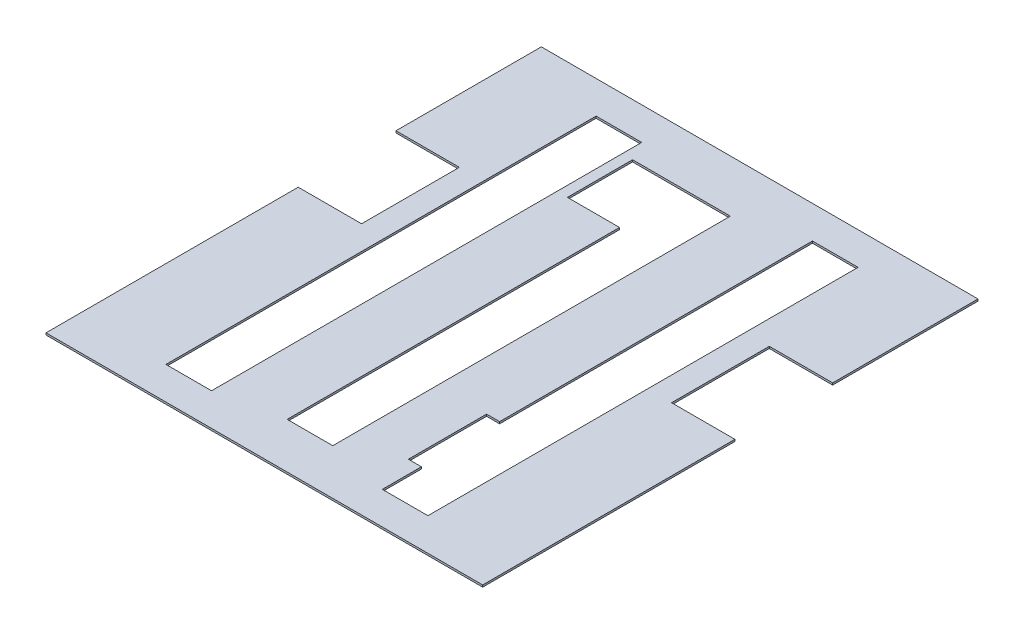
ISO-10303-21;
HEADER;
FILE_DESCRIPTION(('STEP AP214'),'2;1');
FILE_NAME('part.step','',(''),(''),'','','');
FILE_SCHEMA(('AUTOMOTIVE_DESIGN { 1 0 10303 214 1 1 1 1 }'));
ENDSEC;
DATA;
#1=APPLICATION_CONTEXT('core data for automotive mechanical design processes');
#2=APPLICATION_PROTOCOL_DEFINITION('international standard','automotive_design',2000,#1);
#3=PRODUCT_CONTEXT('',#1,'mechanical');
#4=PRODUCT('Part','Part','',(#3));
#5=PRODUCT_RELATED_PRODUCT_CATEGORY('part','',(#4));
#6=PRODUCT_DEFINITION_FORMATION('','',#4);
#7=PRODUCT_DEFINITION_CONTEXT('part definition',#1,'design');
#8=PRODUCT_DEFINITION('design','',#6,#7);
#9=PRODUCT_DEFINITION_SHAPE('','',#8);
#10=(LENGTH_UNIT() NAMED_UNIT(*) SI_UNIT(.MILLI.,.METRE.));
#11=(NAMED_UNIT(*) PLANE_ANGLE_UNIT() SI_UNIT($,.RADIAN.));
#12=(NAMED_UNIT(*) SI_UNIT($,.STERADIAN.) SOLID_ANGLE_UNIT());
#13=UNCERTAINTY_MEASURE_WITH_UNIT(LENGTH_MEASURE(1.E-05),#10,'distance_accuracy_value','');
#14=(GEOMETRIC_REPRESENTATION_CONTEXT(3) GLOBAL_UNCERTAINTY_ASSIGNED_CONTEXT((#13)) GLOBAL_UNIT_ASSIGNED_CONTEXT((#10,
#11,#12)) REPRESENTATION_CONTEXT('',''));
#15=CARTESIAN_POINT('',(0.,0.,0.));
#16=DIRECTION('',(0.,0.,1.));
#17=DIRECTION('',(1.,0.,0.));
#18=AXIS2_PLACEMENT_3D('',#15,#16,#17);
#19=CARTESIAN_POINT('',(6239.08406699949,-8.5,8927.31237778607));
#20=DIRECTION('',(-1.,0.,0.));
#21=DIRECTION('',(0.,0.,1.));
#22=AXIS2_PLACEMENT_3D('',#19,#20,#21);
#23=PLANE('',#22);
#24=DIRECTION('',(0.,0.,1.));
#25=VECTOR('',#24,1.);
#26=CARTESIAN_POINT('',(6239.08406699949,0.,0.));
#27=LINE('',#26,#25);
#28=CARTESIAN_POINT('',(6239.08406699949,0.,8897.31237778607));
#29=VERTEX_POINT('',#28);
#30=CARTESIAN_POINT('',(6239.08406699949,0.,8927.31237778607));
#31=VERTEX_POINT('',#30);
#32=EDGE_CURVE('E450',#29,#31,#27,.T.);
#33=ORIENTED_EDGE('',*,*,#32,.F.);
#34=DIRECTION('',(0.,1.,0.));
#35=VECTOR('',#34,1.);
#36=CARTESIAN_POINT('',(6239.08406699949,-8.5,8897.31237778607));
#37=LINE('',#36,#35);
#38=CARTESIAN_POINT('',(6239.08406699949,1.5,8897.31237778607));
#39=VERTEX_POINT('',#38);
#40=EDGE_CURVE('E41',#29,#39,#37,.T.);
#41=ORIENTED_EDGE('',*,*,#40,.T.);
#42=DIRECTION('',(0.,0.,1.));
#43=VECTOR('',#42,1.);
#44=CARTESIAN_POINT('',(6239.08406699949,1.5,8927.31237778607));
#45=LINE('',#44,#43);
#46=CARTESIAN_POINT('',(6239.08406699949,1.5,8927.31237778607));
#47=VERTEX_POINT('',#46);
#48=EDGE_CURVE('E266',#39,#47,#45,.T.);
#49=ORIENTED_EDGE('',*,*,#48,.T.);
#50=DIRECTION('',(0.,1.,0.));
#51=VECTOR('',#50,1.);
#52=CARTESIAN_POINT('',(6239.08406699949,-8.5,8927.31237778607));
#53=LINE('',#52,#51);
#54=EDGE_CURVE('E276',#31,#47,#53,.T.);
#55=ORIENTED_EDGE('',*,*,#54,.F.);
#56=EDGE_LOOP('',(#33,#41,#49,#55));
#57=FACE_BOUND('',#56,.T.);
#58=ADVANCED_FACE('F33',(#57),#23,.F.);
#59=CARTESIAN_POINT('',(6006.08406699949,1.5,8572.31237778607));
#60=DIRECTION('',(1.,0.,0.));
#61=DIRECTION('',(0.,0.,-1.));
#62=AXIS2_PLACEMENT_3D('',#59,#60,#61);
#63=PLANE('',#62);
#64=DIRECTION('',(0.,0.,1.));
#65=VECTOR('',#64,1.);
#66=CARTESIAN_POINT('',(6006.08406699949,1.5,8572.31237778607));
#67=LINE('',#66,#65);
#68=CARTESIAN_POINT('',(6006.08406699949,1.5,8758.81237778607));
#69=VERTEX_POINT('',#68);
#70=CARTESIAN_POINT('',(6006.08406699949,1.5,8952.31237778607));
#71=VERTEX_POINT('',#70);
#72=EDGE_CURVE('E368',#69,#71,#67,.T.);
#73=ORIENTED_EDGE('',*,*,#72,.F.);
#74=DIRECTION('',(0.,1.,0.));
#75=VECTOR('',#74,1.);
#76=CARTESIAN_POINT('',(6006.08406699949,-8.5,8758.81237778607));
#77=LINE('',#76,#75);
#78=CARTESIAN_POINT('',(6006.08406699949,0.,8758.81237778607));
#79=VERTEX_POINT('',#78);
#80=EDGE_CURVE('E343',#79,#69,#77,.T.);
#81=ORIENTED_EDGE('',*,*,#80,.F.);
#82=DIRECTION('',(0.,0.,1.));
#83=VECTOR('',#82,1.);
#84=CARTESIAN_POINT('',(6006.08406699949,0.,8572.31237778607));
#85=LINE('',#84,#83);
#86=CARTESIAN_POINT('',(6006.08406699949,0.,8952.31237778607));
#87=VERTEX_POINT('',#86);
#88=EDGE_CURVE('E342',#79,#87,#85,.T.);
#89=ORIENTED_EDGE('',*,*,#88,.T.);
#90=DIRECTION('',(0.,-1.,0.));
#91=VECTOR('',#90,1.);
#92=CARTESIAN_POINT('',(6006.08406699949,1.5,8952.31237778607));
#93=LINE('',#92,#91);
#94=EDGE_CURVE('E396',#71,#87,#93,.T.);
#95=ORIENTED_EDGE('',*,*,#94,.F.);
#96=EDGE_LOOP('',(#73,#81,#89,#95));
#97=FACE_BOUND('',#96,.T.);
#98=ADVANCED_FACE('F485',(#97),#63,.F.);
#99=CARTESIAN_POINT('',(6341.08406699949,1.5,8572.31237778607));
#100=DIRECTION('',(-1.,0.,0.));
#101=DIRECTION('',(0.,0.,1.));
#102=AXIS2_PLACEMENT_3D('',#99,#100,#101);
#103=PLANE('',#102);
#104=DIRECTION('',(0.,0.,-1.));
#105=VECTOR('',#104,1.);
#106=CARTESIAN_POINT('',(6341.08406699949,0.,8572.31237778607));
#107=LINE('',#106,#105);
#108=CARTESIAN_POINT('',(6341.08406699949,0.,8952.31237778607));
#109=VERTEX_POINT('',#108);
#110=CARTESIAN_POINT('',(6341.08406699949,0.,8758.81237778607));
#111=VERTEX_POINT('',#110);
#112=EDGE_CURVE('E383',#109,#111,#107,.T.);
#113=ORIENTED_EDGE('',*,*,#112,.T.);
#114=DIRECTION('',(0.,1.,0.));
#115=VECTOR('',#114,1.);
#116=CARTESIAN_POINT('',(6341.08406699949,-8.5,8758.81237778607));
#117=LINE('',#116,#115);
#118=CARTESIAN_POINT('',(6341.08406699949,1.5,8758.81237778607));
#119=VERTEX_POINT('',#118);
#120=EDGE_CURVE('E334',#111,#119,#117,.T.);
#121=ORIENTED_EDGE('',*,*,#120,.T.);
#122=DIRECTION('',(0.,0.,-1.));
#123=VECTOR('',#122,1.);
#124=CARTESIAN_POINT('',(6341.08406699949,1.5,8572.31237778607));
#125=LINE('',#124,#123);
#126=CARTESIAN_POINT('',(6341.08406699949,1.5,8952.31237778607));
#127=VERTEX_POINT('',#126);
#128=EDGE_CURVE('E371',#127,#119,#125,.T.);
#129=ORIENTED_EDGE('',*,*,#128,.F.);
#130=DIRECTION('',(0.,-1.,0.));
#131=VECTOR('',#130,1.);
#132=CARTESIAN_POINT('',(6341.08406699949,1.5,8952.31237778607));
#133=LINE('',#132,#131);
#134=EDGE_CURVE('E393',#127,#109,#133,.T.);
#135=ORIENTED_EDGE('',*,*,#134,.T.);
#136=EDGE_LOOP('',(#113,#121,#129,#135));
#137=FACE_BOUND('',#136,.T.);
#138=ADVANCED_FACE('F491',(#137),#103,.F.);
#139=CARTESIAN_POINT('',(6006.08406699949,0.,8572.31237778607));
#140=VERTEX_POINT('',#139);
#141=CARTESIAN_POINT('',(6006.08406699949,0.,8683.81237778607));
#142=VERTEX_POINT('',#141);
#143=EDGE_CURVE('E377',#140,#142,#85,.T.);
#144=ORIENTED_EDGE('',*,*,#143,.T.);
#145=DIRECTION('',(0.,1.,0.));
#146=VECTOR('',#145,1.);
#147=CARTESIAN_POINT('',(6006.08406699949,-8.5,8683.81237778607));
#148=LINE('',#147,#146);
#149=CARTESIAN_POINT('',(6006.08406699949,1.5,8683.81237778607));
#150=VERTEX_POINT('',#149);
#151=EDGE_CURVE('E345',#142,#150,#148,.T.);
#152=ORIENTED_EDGE('',*,*,#151,.T.);
#153=CARTESIAN_POINT('',(6006.08406699949,1.5,8572.31237778607));
#154=VERTEX_POINT('',#153);
#155=EDGE_CURVE('E364',#154,#150,#67,.T.);
#156=ORIENTED_EDGE('',*,*,#155,.F.);
#157=DIRECTION('',(0.,-1.,0.));
#158=VECTOR('',#157,1.);
#159=CARTESIAN_POINT('',(6006.08406699949,1.5,8572.31237778607));
#160=LINE('',#159,#158);
#161=EDGE_CURVE('E376',#154,#140,#160,.T.);
#162=ORIENTED_EDGE('',*,*,#161,.T.);
#163=EDGE_LOOP('',(#144,#152,#156,#162));
#164=FACE_BOUND('',#163,.T.);
#165=ADVANCED_FACE('F35',(#164),#63,.F.);
#166=CARTESIAN_POINT('',(6006.08406699949,1.5,8952.31237778607));
#167=DIRECTION('',(0.,0.,-1.));
#168=DIRECTION('',(-1.,0.,0.));
#169=AXIS2_PLACEMENT_3D('',#166,#167,#168);
#170=PLANE('',#169);
#171=DIRECTION('',(1.,0.,0.));
#172=VECTOR('',#171,1.);
#173=CARTESIAN_POINT('',(6006.08406699949,0.,8952.31237778607));
#174=LINE('',#173,#172);
#175=EDGE_CURVE('E380',#87,#109,#174,.T.);
#176=ORIENTED_EDGE('',*,*,#175,.T.);
#177=ORIENTED_EDGE('',*,*,#134,.F.);
#178=DIRECTION('',(1.,0.,0.));
#179=VECTOR('',#178,1.);
#180=CARTESIAN_POINT('',(6006.08406699949,1.5,8952.31237778607));
#181=LINE('',#180,#179);
#182=EDGE_CURVE('E367',#71,#127,#181,.T.);
#183=ORIENTED_EDGE('',*,*,#182,.F.);
#184=ORIENTED_EDGE('',*,*,#94,.T.);
#185=EDGE_LOOP('',(#176,#177,#183,#184));
#186=FACE_BOUND('',#185,.T.);
#187=ADVANCED_FACE('F583',(#186),#170,.F.);
#188=CARTESIAN_POINT('',(6341.08406699949,1.5,8683.81237778607));
#189=VERTEX_POINT('',#188);
#190=CARTESIAN_POINT('',(6341.08406699949,1.5,8572.31237778607));
#191=VERTEX_POINT('',#190);
#192=EDGE_CURVE('E370',#189,#191,#125,.T.);
#193=ORIENTED_EDGE('',*,*,#192,.F.);
#194=DIRECTION('',(0.,1.,0.));
#195=VECTOR('',#194,1.);
#196=CARTESIAN_POINT('',(6341.08406699949,-8.5,8683.81237778607));
#197=LINE('',#196,#195);
#198=CARTESIAN_POINT('',(6341.08406699949,0.,8683.81237778607));
#199=VERTEX_POINT('',#198);
#200=EDGE_CURVE('E356',#199,#189,#197,.T.);
#201=ORIENTED_EDGE('',*,*,#200,.F.);
#202=CARTESIAN_POINT('',(6341.08406699949,0.,8572.31237778607));
#203=VERTEX_POINT('',#202);
#204=EDGE_CURVE('E382',#199,#203,#107,.T.);
#205=ORIENTED_EDGE('',*,*,#204,.T.);
#206=DIRECTION('',(0.,-1.,0.));
#207=VECTOR('',#206,1.);
#208=CARTESIAN_POINT('',(6341.08406699949,1.5,8572.31237778607));
#209=LINE('',#208,#207);
#210=EDGE_CURVE('E390',#191,#203,#209,.T.);
#211=ORIENTED_EDGE('',*,*,#210,.F.);
#212=EDGE_LOOP('',(#193,#201,#205,#211));
#213=FACE_BOUND('',#212,.T.);
#214=ADVANCED_FACE('F580',(#213),#103,.F.);
#215=CARTESIAN_POINT('',(6006.08406699949,1.5,8572.31237778607));
#216=DIRECTION('',(0.,0.,1.));
#217=DIRECTION('',(1.,0.,0.));
#218=AXIS2_PLACEMENT_3D('',#215,#216,#217);
#219=PLANE('',#218);
#220=DIRECTION('',(-1.,0.,0.));
#221=VECTOR('',#220,1.);
#222=CARTESIAN_POINT('',(6006.08406699949,0.,8572.31237778607));
#223=LINE('',#222,#221);
#224=EDGE_CURVE('E386',#203,#140,#223,.T.);
#225=ORIENTED_EDGE('',*,*,#224,.T.);
#226=ORIENTED_EDGE('',*,*,#161,.F.);
#227=DIRECTION('',(-1.,0.,0.));
#228=VECTOR('',#227,1.);
#229=CARTESIAN_POINT('',(6006.08406699949,1.5,8572.31237778607));
#230=LINE('',#229,#228);
#231=EDGE_CURVE('E374',#191,#154,#230,.T.);
#232=ORIENTED_EDGE('',*,*,#231,.F.);
#233=ORIENTED_EDGE('',*,*,#210,.T.);
#234=EDGE_LOOP('',(#225,#226,#232,#233));
#235=FACE_BOUND('',#234,.T.);
#236=ADVANCED_FACE('F575',(#235),#219,.F.);
#237=CARTESIAN_POINT('',(0.,1.5,0.));
#238=DIRECTION('',(0.,1.,0.));
#239=DIRECTION('',(0.,0.,1.));
#240=AXIS2_PLACEMENT_3D('',#237,#238,#239);
#241=PLANE('',#240);
#242=DIRECTION('',(1.,0.,0.));
#243=VECTOR('',#242,1.);
#244=CARTESIAN_POINT('',(6246.08406699949,1.5,8897.31237778607));
#245=LINE('',#244,#243);
#246=CARTESIAN_POINT('',(6229.08406699949,1.5,8897.31237778607));
#247=VERTEX_POINT('',#246);
#248=EDGE_CURVE('E239',#247,#39,#245,.T.);
#249=ORIENTED_EDGE('',*,*,#248,.F.);
#250=DIRECTION('',(0.,0.,1.));
#251=VECTOR('',#250,1.);
#252=CARTESIAN_POINT('',(6229.08406699949,1.5,8897.31237778607));
#253=LINE('',#252,#251);
#254=CARTESIAN_POINT('',(6229.08406699949,1.5,8837.31237778607));
#255=VERTEX_POINT('',#254);
#256=EDGE_CURVE('E236',#255,#247,#253,.T.);
#257=ORIENTED_EDGE('',*,*,#256,.F.);
#258=DIRECTION('',(-1.,0.,0.));
#259=VECTOR('',#258,1.);
#260=CARTESIAN_POINT('',(6246.08406699949,1.5,8837.31237778607));
#261=LINE('',#260,#259);
#262=CARTESIAN_POINT('',(6239.08406699949,1.5,8837.31237778607));
#263=VERTEX_POINT('',#262);
#264=EDGE_CURVE('E242',#263,#255,#261,.T.);
#265=ORIENTED_EDGE('',*,*,#264,.F.);
#266=CARTESIAN_POINT('',(6239.08406699949,1.5,8597.31237778607));
#267=VERTEX_POINT('',#266);
#268=EDGE_CURVE('E267',#267,#263,#45,.T.);
#269=ORIENTED_EDGE('',*,*,#268,.F.);
#270=DIRECTION('',(-1.,0.,0.));
#271=VECTOR('',#270,1.);
#272=CARTESIAN_POINT('',(6274.08406699949,1.5,8597.31237778607));
#273=LINE('',#272,#271);
#274=CARTESIAN_POINT('',(6274.08406699949,1.5,8597.31237778607));
#275=VERTEX_POINT('',#274);
#276=EDGE_CURVE('E262',#275,#267,#273,.T.);
#277=ORIENTED_EDGE('',*,*,#276,.F.);
#278=DIRECTION('',(0.,0.,-1.));
#279=VECTOR('',#278,1.);
#280=CARTESIAN_POINT('',(6274.08406699949,1.5,8927.31237778607));
#281=LINE('',#280,#279);
#282=CARTESIAN_POINT('',(6274.08406699949,1.5,8927.31237778607));
#283=VERTEX_POINT('',#282);
#284=EDGE_CURVE('E56',#283,#275,#281,.T.);
#285=ORIENTED_EDGE('',*,*,#284,.F.);
#286=DIRECTION('',(1.,0.,0.));
#287=VECTOR('',#286,1.);
#288=CARTESIAN_POINT('',(6274.08406699949,1.5,8927.31237778607));
#289=LINE('',#288,#287);
#290=EDGE_CURVE('E269',#47,#283,#289,.T.);
#291=ORIENTED_EDGE('',*,*,#290,.F.);
#292=ORIENTED_EDGE('',*,*,#48,.F.);
#293=EDGE_LOOP('',(#249,#257,#265,#269,#277,#285,#291,#292));
#294=FACE_BOUND('',#293,.T.);
#295=DIRECTION('',(0.,0.,1.));
#296=VECTOR('',#295,1.);
#297=CARTESIAN_POINT('',(6073.08406699949,1.5,8597.31237778608));
#298=LINE('',#297,#296);
#299=CARTESIAN_POINT('',(6073.08406699949,1.5,8597.31237778608));
#300=VERTEX_POINT('',#299);
#301=CARTESIAN_POINT('',(6073.08406699949,1.5,8927.31237778607));
#302=VERTEX_POINT('',#301);
#303=EDGE_CURVE('E282',#300,#302,#298,.T.);
#304=ORIENTED_EDGE('',*,*,#303,.F.);
#305=DIRECTION('',(-1.,0.,0.));
#306=VECTOR('',#305,1.);
#307=CARTESIAN_POINT('',(6073.08406699949,1.5,8597.31237778608));
#308=LINE('',#307,#306);
#309=CARTESIAN_POINT('',(6108.08406699949,1.5,8597.31237778608));
#310=VERTEX_POINT('',#309);
#311=EDGE_CURVE('E291',#310,#300,#308,.T.);
#312=ORIENTED_EDGE('',*,*,#311,.F.);
#313=DIRECTION('',(0.,0.,-1.));
#314=VECTOR('',#313,1.);
#315=CARTESIAN_POINT('',(6108.08406699949,1.5,8597.31237778608));
#316=LINE('',#315,#314);
#317=CARTESIAN_POINT('',(6108.08406699949,1.5,8927.31237778607));
#318=VERTEX_POINT('',#317);
#319=EDGE_CURVE('E288',#318,#310,#316,.T.);
#320=ORIENTED_EDGE('',*,*,#319,.F.);
#321=DIRECTION('',(1.,0.,0.));
#322=VECTOR('',#321,1.);
#323=CARTESIAN_POINT('',(6073.08406699949,1.5,8927.31237778607));
#324=LINE('',#323,#322);
#325=EDGE_CURVE('E284',#302,#318,#324,.T.);
#326=ORIENTED_EDGE('',*,*,#325,.F.);
#327=EDGE_LOOP('',(#304,#312,#320,#326));
#328=FACE_BOUND('',#327,.T.);
#329=DIRECTION('',(0.,0.,1.));
#330=VECTOR('',#329,1.);
#331=CARTESIAN_POINT('',(6116.08406699949,1.5,8612.31237778607));
#332=LINE('',#331,#330);
#333=CARTESIAN_POINT('',(6116.08406699949,1.5,8612.31237778607));
#334=VERTEX_POINT('',#333);
#335=CARTESIAN_POINT('',(6116.08406699949,1.5,8662.31237778607));
#336=VERTEX_POINT('',#335);
#337=EDGE_CURVE('E260',#334,#336,#332,.T.);
#338=ORIENTED_EDGE('',*,*,#337,.F.);
#339=DIRECTION('',(-1.,0.,0.));
#340=VECTOR('',#339,1.);
#341=CARTESIAN_POINT('',(6116.08406699949,1.5,8612.31237778607));
#342=LINE('',#341,#340);
#343=CARTESIAN_POINT('',(6191.08406699949,1.5,8612.31237778607));
#344=VERTEX_POINT('',#343);
#345=EDGE_CURVE('E315',#344,#334,#342,.T.);
#346=ORIENTED_EDGE('',*,*,#345,.F.);
#347=DIRECTION('',(0.,0.,-1.));
#348=VECTOR('',#347,1.);
#349=CARTESIAN_POINT('',(6191.08406699949,1.5,8612.31237778607));
#350=LINE('',#349,#348);
#351=CARTESIAN_POINT('',(6191.08406699949,1.5,8917.31237778607));
#352=VERTEX_POINT('',#351);
#353=EDGE_CURVE('E312',#352,#344,#350,.T.);
#354=ORIENTED_EDGE('',*,*,#353,.F.);
#355=DIRECTION('',(1.,0.,0.));
#356=VECTOR('',#355,1.);
#357=CARTESIAN_POINT('',(6156.08406699949,1.5,8917.31237778607));
#358=LINE('',#357,#356);
#359=CARTESIAN_POINT('',(6156.08406699949,1.5,8917.31237778607));
#360=VERTEX_POINT('',#359);
#361=EDGE_CURVE('E309',#360,#352,#358,.T.);
#362=ORIENTED_EDGE('',*,*,#361,.F.);
#363=DIRECTION('',(0.,0.,1.));
#364=VECTOR('',#363,1.);
#365=CARTESIAN_POINT('',(6156.08406699949,1.5,8662.31237778607));
#366=LINE('',#365,#364);
#367=CARTESIAN_POINT('',(6156.08406699949,1.5,8662.31237778607));
#368=VERTEX_POINT('',#367);
#369=EDGE_CURVE('E306',#368,#360,#366,.T.);
#370=ORIENTED_EDGE('',*,*,#369,.F.);
#371=DIRECTION('',(1.,0.,0.));
#372=VECTOR('',#371,1.);
#373=CARTESIAN_POINT('',(6156.08406699949,1.5,8662.31237778607));
#374=LINE('',#373,#372);
#375=EDGE_CURVE('E303',#336,#368,#374,.T.);
#376=ORIENTED_EDGE('',*,*,#375,.F.);
#377=EDGE_LOOP('',(#338,#346,#354,#362,#370,#376));
#378=FACE_BOUND('',#377,.T.);
#379=DIRECTION('',(1.,0.,0.));
#380=VECTOR('',#379,1.);
#381=CARTESIAN_POINT('',(6054.68406699949,1.5,8758.81237778607));
#382=LINE('',#381,#380);
#383=CARTESIAN_POINT('',(6054.68406699949,1.5,8758.81237778607));
#384=VERTEX_POINT('',#383);
#385=EDGE_CURVE('E336',#69,#384,#382,.T.);
#386=ORIENTED_EDGE('',*,*,#385,.F.);
#387=ORIENTED_EDGE('',*,*,#72,.T.);
#388=ORIENTED_EDGE('',*,*,#182,.T.);
#389=ORIENTED_EDGE('',*,*,#128,.T.);
#390=DIRECTION('',(1.,0.,0.));
#391=VECTOR('',#390,1.);
#392=CARTESIAN_POINT('',(6341.08406699949,1.5,8758.81237778607));
#393=LINE('',#392,#391);
#394=CARTESIAN_POINT('',(6292.48406699949,1.5,8758.81237778607));
#395=VERTEX_POINT('',#394);
#396=EDGE_CURVE('E354',#395,#119,#393,.T.);
#397=ORIENTED_EDGE('',*,*,#396,.F.);
#398=DIRECTION('',(0.,0.,1.));
#399=VECTOR('',#398,1.);
#400=CARTESIAN_POINT('',(6292.48406699949,1.5,8758.81237778607));
#401=LINE('',#400,#399);
#402=CARTESIAN_POINT('',(6292.48406699949,1.5,8683.81237778607));
#403=VERTEX_POINT('',#402);
#404=EDGE_CURVE('E351',#403,#395,#401,.T.);
#405=ORIENTED_EDGE('',*,*,#404,.F.);
#406=DIRECTION('',(-1.,0.,0.));
#407=VECTOR('',#406,1.);
#408=CARTESIAN_POINT('',(6341.08406699949,1.5,8683.81237778607));
#409=LINE('',#408,#407);
#410=EDGE_CURVE('E275',#189,#403,#409,.T.);
#411=ORIENTED_EDGE('',*,*,#410,.F.);
#412=ORIENTED_EDGE('',*,*,#192,.T.);
#413=ORIENTED_EDGE('',*,*,#231,.T.);
#414=ORIENTED_EDGE('',*,*,#155,.T.);
#415=DIRECTION('',(-1.,0.,0.));
#416=VECTOR('',#415,1.);
#417=CARTESIAN_POINT('',(6054.68406699949,1.5,8683.81237778607));
#418=LINE('',#417,#416);
#419=CARTESIAN_POINT('',(6054.68406699949,1.5,8683.81237778607));
#420=VERTEX_POINT('',#419);
#421=EDGE_CURVE('E333',#420,#150,#418,.T.);
#422=ORIENTED_EDGE('',*,*,#421,.F.);
#423=DIRECTION('',(0.,0.,-1.));
#424=VECTOR('',#423,1.);
#425=CARTESIAN_POINT('',(6054.68406699949,1.5,8758.81237778607));
#426=LINE('',#425,#424);
#427=EDGE_CURVE('E330',#384,#420,#426,.T.);
#428=ORIENTED_EDGE('',*,*,#427,.F.);
#429=EDGE_LOOP('',(#386,#387,#388,#389,#397,#405,#411,#412,#413,#414,#422,#428));
#430=FACE_BOUND('',#429,.T.);
#431=ADVANCED_FACE('F249',(#294,#328,#378,#430),#241,.T.);
#432=CARTESIAN_POINT('',(0.,0.,0.));
#433=DIRECTION('',(0.,1.,0.));
#434=DIRECTION('',(0.,0.,1.));
#435=AXIS2_PLACEMENT_3D('',#432,#433,#434);
#436=PLANE('',#435);
#437=DIRECTION('',(0.,0.,1.));
#438=VECTOR('',#437,1.);
#439=CARTESIAN_POINT('',(6229.08406699949,0.,0.));
#440=LINE('',#439,#438);
#441=CARTESIAN_POINT('',(6229.08406699949,0.,8837.31237778607));
#442=VERTEX_POINT('',#441);
#443=CARTESIAN_POINT('',(6229.08406699949,0.,8897.31237778607));
#444=VERTEX_POINT('',#443);
#445=EDGE_CURVE('E11',#442,#444,#440,.T.);
#446=ORIENTED_EDGE('',*,*,#445,.T.);
#447=DIRECTION('',(1.,0.,0.));
#448=VECTOR('',#447,1.);
#449=CARTESIAN_POINT('',(0.,0.,8897.31237778607));
#450=LINE('',#449,#448);
#451=EDGE_CURVE('E257',#444,#29,#450,.T.);
#452=ORIENTED_EDGE('',*,*,#451,.T.);
#453=ORIENTED_EDGE('',*,*,#32,.T.);
#454=DIRECTION('',(1.,0.,0.));
#455=VECTOR('',#454,1.);
#456=CARTESIAN_POINT('',(0.,0.,8927.31237778607));
#457=LINE('',#456,#455);
#458=CARTESIAN_POINT('',(6274.08406699949,0.,8927.31237778607));
#459=VERTEX_POINT('',#458);
#460=EDGE_CURVE('E454',#31,#459,#457,.T.);
#461=ORIENTED_EDGE('',*,*,#460,.T.);
#462=DIRECTION('',(0.,0.,-1.));
#463=VECTOR('',#462,1.);
#464=CARTESIAN_POINT('',(6274.08406699949,0.,0.));
#465=LINE('',#464,#463);
#466=CARTESIAN_POINT('',(6274.08406699949,0.,8597.31237778607));
#467=VERTEX_POINT('',#466);
#468=EDGE_CURVE('E457',#459,#467,#465,.T.);
#469=ORIENTED_EDGE('',*,*,#468,.T.);
#470=DIRECTION('',(-1.,0.,0.));
#471=VECTOR('',#470,1.);
#472=CARTESIAN_POINT('',(0.,0.,8597.31237778607));
#473=LINE('',#472,#471);
#474=CARTESIAN_POINT('',(6239.08406699949,0.,8597.31237778607));
#475=VERTEX_POINT('',#474);
#476=EDGE_CURVE('E447',#467,#475,#473,.T.);
#477=ORIENTED_EDGE('',*,*,#476,.T.);
#478=CARTESIAN_POINT('',(6239.08406699949,0.,8837.31237778607));
#479=VERTEX_POINT('',#478);
#480=EDGE_CURVE('E451',#475,#479,#27,.T.);
#481=ORIENTED_EDGE('',*,*,#480,.T.);
#482=DIRECTION('',(-1.,0.,0.));
#483=VECTOR('',#482,1.);
#484=CARTESIAN_POINT('',(0.,0.,8837.31237778607));
#485=LINE('',#484,#483);
#486=EDGE_CURVE('E48',#479,#442,#485,.T.);
#487=ORIENTED_EDGE('',*,*,#486,.T.);
#488=EDGE_LOOP('',(#446,#452,#453,#461,#469,#477,#481,#487));
#489=FACE_BOUND('',#488,.T.);
#490=DIRECTION('',(-1.,0.,0.));
#491=VECTOR('',#490,1.);
#492=CARTESIAN_POINT('',(0.,0.,8597.31237778608));
#493=LINE('',#492,#491);
#494=CARTESIAN_POINT('',(6108.08406699949,0.,8597.31237778608));
#495=VERTEX_POINT('',#494);
#496=CARTESIAN_POINT('',(6073.08406699949,0.,8597.31237778608));
#497=VERTEX_POINT('',#496);
#498=EDGE_CURVE('E441',#495,#497,#493,.T.);
#499=ORIENTED_EDGE('',*,*,#498,.T.);
#500=DIRECTION('',(0.,0.,1.));
#501=VECTOR('',#500,1.);
#502=CARTESIAN_POINT('',(6073.08406699949,0.,0.));
#503=LINE('',#502,#501);
#504=CARTESIAN_POINT('',(6073.08406699949,0.,8927.31237778607));
#505=VERTEX_POINT('',#504);
#506=EDGE_CURVE('E444',#497,#505,#503,.T.);
#507=ORIENTED_EDGE('',*,*,#506,.T.);
#508=DIRECTION('',(1.,0.,0.));
#509=VECTOR('',#508,1.);
#510=CARTESIAN_POINT('',(0.,0.,8927.31237778607));
#511=LINE('',#510,#509);
#512=CARTESIAN_POINT('',(6108.08406699949,0.,8927.31237778607));
#513=VERTEX_POINT('',#512);
#514=EDGE_CURVE('E435',#505,#513,#511,.T.);
#515=ORIENTED_EDGE('',*,*,#514,.T.);
#516=DIRECTION('',(0.,0.,-1.));
#517=VECTOR('',#516,1.);
#518=CARTESIAN_POINT('',(6108.08406699949,0.,0.));
#519=LINE('',#518,#517);
#520=EDGE_CURVE('E438',#513,#495,#519,.T.);
#521=ORIENTED_EDGE('',*,*,#520,.T.);
#522=EDGE_LOOP('',(#499,#507,#515,#521));
#523=FACE_BOUND('',#522,.T.);
#524=DIRECTION('',(-1.,0.,0.));
#525=VECTOR('',#524,1.);
#526=CARTESIAN_POINT('',(0.,0.,8612.31237778607));
#527=LINE('',#526,#525);
#528=CARTESIAN_POINT('',(6191.08406699949,0.,8612.31237778607));
#529=VERTEX_POINT('',#528);
#530=CARTESIAN_POINT('',(6116.08406699949,0.,8612.31237778607));
#531=VERTEX_POINT('',#530);
#532=EDGE_CURVE('E429',#529,#531,#527,.T.);
#533=ORIENTED_EDGE('',*,*,#532,.T.);
#534=DIRECTION('',(0.,0.,1.));
#535=VECTOR('',#534,1.);
#536=CARTESIAN_POINT('',(6116.08406699949,0.,0.));
#537=LINE('',#536,#535);
#538=CARTESIAN_POINT('',(6116.08406699949,0.,8662.31237778607));
#539=VERTEX_POINT('',#538);
#540=EDGE_CURVE('E432',#531,#539,#537,.T.);
#541=ORIENTED_EDGE('',*,*,#540,.T.);
#542=DIRECTION('',(1.,0.,0.));
#543=VECTOR('',#542,1.);
#544=CARTESIAN_POINT('',(0.,0.,8662.31237778607));
#545=LINE('',#544,#543);
#546=CARTESIAN_POINT('',(6156.08406699949,0.,8662.31237778607));
#547=VERTEX_POINT('',#546);
#548=EDGE_CURVE('E417',#539,#547,#545,.T.);
#549=ORIENTED_EDGE('',*,*,#548,.T.);
#550=DIRECTION('',(0.,0.,1.));
#551=VECTOR('',#550,1.);
#552=CARTESIAN_POINT('',(6156.08406699949,0.,0.));
#553=LINE('',#552,#551);
#554=CARTESIAN_POINT('',(6156.08406699949,0.,8917.31237778607));
#555=VERTEX_POINT('',#554);
#556=EDGE_CURVE('E420',#547,#555,#553,.T.);
#557=ORIENTED_EDGE('',*,*,#556,.T.);
#558=DIRECTION('',(1.,0.,0.));
#559=VECTOR('',#558,1.);
#560=CARTESIAN_POINT('',(0.,0.,8917.31237778607));
#561=LINE('',#560,#559);
#562=CARTESIAN_POINT('',(6191.08406699949,0.,8917.31237778607));
#563=VERTEX_POINT('',#562);
#564=EDGE_CURVE('E423',#555,#563,#561,.T.);
#565=ORIENTED_EDGE('',*,*,#564,.T.);
#566=DIRECTION('',(0.,0.,-1.));
#567=VECTOR('',#566,1.);
#568=CARTESIAN_POINT('',(6191.08406699949,0.,0.));
#569=LINE('',#568,#567);
#570=EDGE_CURVE('E426',#563,#529,#569,.T.);
#571=ORIENTED_EDGE('',*,*,#570,.T.);
#572=EDGE_LOOP('',(#533,#541,#549,#557,#565,#571));
#573=FACE_BOUND('',#572,.T.);
#574=ORIENTED_EDGE('',*,*,#88,.F.);
#575=DIRECTION('',(1.,0.,0.));
#576=VECTOR('',#575,1.);
#577=CARTESIAN_POINT('',(0.,0.,8758.81237778607));
#578=LINE('',#577,#576);
#579=CARTESIAN_POINT('',(6054.68406699949,0.,8758.81237778607));
#580=VERTEX_POINT('',#579);
#581=EDGE_CURVE('E414',#79,#580,#578,.T.);
#582=ORIENTED_EDGE('',*,*,#581,.T.);
#583=DIRECTION('',(0.,0.,-1.));
#584=VECTOR('',#583,1.);
#585=CARTESIAN_POINT('',(6054.68406699939,0.,-7.17018630188146E-11));
#586=LINE('',#585,#584);
#587=CARTESIAN_POINT('',(6054.68406699949,0.,8683.81237778607));
#588=VERTEX_POINT('',#587);
#589=EDGE_CURVE('E411',#580,#588,#586,.T.);
#590=ORIENTED_EDGE('',*,*,#589,.T.);
#591=DIRECTION('',(-1.,0.,0.));
#592=VECTOR('',#591,1.);
#593=CARTESIAN_POINT('',(0.,0.,8683.81237778607));
#594=LINE('',#593,#592);
#595=EDGE_CURVE('E408',#588,#142,#594,.T.);
#596=ORIENTED_EDGE('',*,*,#595,.T.);
#597=ORIENTED_EDGE('',*,*,#143,.F.);
#598=ORIENTED_EDGE('',*,*,#224,.F.);
#599=ORIENTED_EDGE('',*,*,#204,.F.);
#600=DIRECTION('',(-1.,0.,0.));
#601=VECTOR('',#600,1.);
#602=CARTESIAN_POINT('',(0.,0.,8683.81237778607));
#603=LINE('',#602,#601);
#604=CARTESIAN_POINT('',(6292.48406699949,0.,8683.81237778607));
#605=VERTEX_POINT('',#604);
#606=EDGE_CURVE('E399',#199,#605,#603,.T.);
#607=ORIENTED_EDGE('',*,*,#606,.T.);
#608=DIRECTION('',(0.,0.,1.));
#609=VECTOR('',#608,1.);
#610=CARTESIAN_POINT('',(6292.48406699949,0.,0.));
#611=LINE('',#610,#609);
#612=CARTESIAN_POINT('',(6292.48406699949,0.,8758.81237778607));
#613=VERTEX_POINT('',#612);
#614=EDGE_CURVE('E402',#605,#613,#611,.T.);
#615=ORIENTED_EDGE('',*,*,#614,.T.);
#616=DIRECTION('',(1.,0.,0.));
#617=VECTOR('',#616,1.);
#618=CARTESIAN_POINT('',(0.,0.,8758.81237778607));
#619=LINE('',#618,#617);
#620=EDGE_CURVE('E405',#613,#111,#619,.T.);
#621=ORIENTED_EDGE('',*,*,#620,.T.);
#622=ORIENTED_EDGE('',*,*,#112,.F.);
#623=ORIENTED_EDGE('',*,*,#175,.F.);
#624=EDGE_LOOP('',(#574,#582,#590,#596,#597,#598,#599,#607,#615,#621,#622,#623));
#625=FACE_BOUND('',#624,.T.);
#626=ADVANCED_FACE('F472',(#489,#523,#573,#625),#436,.F.);
#627=CARTESIAN_POINT('',(6341.08406699949,-8.5,8758.81237778607));
#628=DIRECTION('',(0.,0.,1.));
#629=DIRECTION('',(1.,0.,0.));
#630=AXIS2_PLACEMENT_3D('',#627,#628,#629);
#631=PLANE('',#630);
#632=DIRECTION('',(0.,1.,0.));
#633=VECTOR('',#632,1.);
#634=CARTESIAN_POINT('',(6292.48406699949,-8.5,8758.81237778607));
#635=LINE('',#634,#633);
#636=EDGE_CURVE('E359',#613,#395,#635,.T.);
#637=ORIENTED_EDGE('',*,*,#636,.T.);
#638=ORIENTED_EDGE('',*,*,#396,.T.);
#639=ORIENTED_EDGE('',*,*,#120,.F.);
#640=ORIENTED_EDGE('',*,*,#620,.F.);
#641=EDGE_LOOP('',(#637,#638,#639,#640));
#642=FACE_BOUND('',#641,.T.);
#643=ADVANCED_FACE('F562',(#642),#631,.F.);
#644=CARTESIAN_POINT('',(6292.48406699949,-8.5,8758.81237778607));
#645=DIRECTION('',(-1.,0.,0.));
#646=DIRECTION('',(0.,0.,1.));
#647=AXIS2_PLACEMENT_3D('',#644,#645,#646);
#648=PLANE('',#647);
#649=DIRECTION('',(0.,1.,0.));
#650=VECTOR('',#649,1.);
#651=CARTESIAN_POINT('',(6292.48406699949,-8.5,8683.81237778607));
#652=LINE('',#651,#650);
#653=EDGE_CURVE('E361',#605,#403,#652,.T.);
#654=ORIENTED_EDGE('',*,*,#653,.T.);
#655=ORIENTED_EDGE('',*,*,#404,.T.);
#656=ORIENTED_EDGE('',*,*,#636,.F.);
#657=ORIENTED_EDGE('',*,*,#614,.F.);
#658=EDGE_LOOP('',(#654,#655,#656,#657));
#659=FACE_BOUND('',#658,.T.);
#660=ADVANCED_FACE('F565',(#659),#648,.F.);
#661=CARTESIAN_POINT('',(6341.08406699949,-8.5,8683.81237778607));
#662=DIRECTION('',(0.,0.,-1.));
#663=DIRECTION('',(-1.,0.,0.));
#664=AXIS2_PLACEMENT_3D('',#661,#662,#663);
#665=PLANE('',#664);
#666=ORIENTED_EDGE('',*,*,#200,.T.);
#667=ORIENTED_EDGE('',*,*,#410,.T.);
#668=ORIENTED_EDGE('',*,*,#653,.F.);
#669=ORIENTED_EDGE('',*,*,#606,.F.);
#670=EDGE_LOOP('',(#666,#667,#668,#669));
#671=FACE_BOUND('',#670,.T.);
#672=ADVANCED_FACE('F560',(#671),#665,.F.);
#673=CARTESIAN_POINT('',(6054.68406699949,-8.5,8758.81237778607));
#674=DIRECTION('',(1.,0.,0.));
#675=DIRECTION('',(0.,0.,-1.));
#676=AXIS2_PLACEMENT_3D('',#673,#674,#675);
#677=PLANE('',#676);
#678=DIRECTION('',(0.,1.,0.));
#679=VECTOR('',#678,1.);
#680=CARTESIAN_POINT('',(6054.68406699949,-8.5,8758.81237778607));
#681=LINE('',#680,#679);
#682=EDGE_CURVE('E340',#580,#384,#681,.T.);
#683=ORIENTED_EDGE('',*,*,#682,.T.);
#684=ORIENTED_EDGE('',*,*,#427,.T.);
#685=DIRECTION('',(0.,1.,0.));
#686=VECTOR('',#685,1.);
#687=CARTESIAN_POINT('',(6054.68406699949,-8.5,8683.81237778607));
#688=LINE('',#687,#686);
#689=EDGE_CURVE('E339',#588,#420,#688,.T.);
#690=ORIENTED_EDGE('',*,*,#689,.F.);
#691=ORIENTED_EDGE('',*,*,#589,.F.);
#692=EDGE_LOOP('',(#683,#684,#690,#691));
#693=FACE_BOUND('',#692,.T.);
#694=ADVANCED_FACE('F553',(#693),#677,.F.);
#695=CARTESIAN_POINT('',(6054.68406699949,-8.5,8758.81237778607));
#696=DIRECTION('',(0.,0.,1.));
#697=DIRECTION('',(1.,0.,0.));
#698=AXIS2_PLACEMENT_3D('',#695,#696,#697);
#699=PLANE('',#698);
#700=ORIENTED_EDGE('',*,*,#80,.T.);
#701=ORIENTED_EDGE('',*,*,#385,.T.);
#702=ORIENTED_EDGE('',*,*,#682,.F.);
#703=ORIENTED_EDGE('',*,*,#581,.F.);
#704=EDGE_LOOP('',(#700,#701,#702,#703));
#705=FACE_BOUND('',#704,.T.);
#706=ADVANCED_FACE('F550',(#705),#699,.F.);
#707=CARTESIAN_POINT('',(6054.68406699949,-8.5,8683.81237778607));
#708=DIRECTION('',(0.,0.,-1.));
#709=DIRECTION('',(-1.,0.,0.));
#710=AXIS2_PLACEMENT_3D('',#707,#708,#709);
#711=PLANE('',#710);
#712=ORIENTED_EDGE('',*,*,#689,.T.);
#713=ORIENTED_EDGE('',*,*,#421,.T.);
#714=ORIENTED_EDGE('',*,*,#151,.F.);
#715=ORIENTED_EDGE('',*,*,#595,.F.);
#716=EDGE_LOOP('',(#712,#713,#714,#715));
#717=FACE_BOUND('',#716,.T.);
#718=ADVANCED_FACE('F548',(#717),#711,.F.);
#719=CARTESIAN_POINT('',(6116.08406699949,-8.5,8612.31237778607));
#720=DIRECTION('',(-1.,0.,0.));
#721=DIRECTION('',(0.,0.,1.));
#722=AXIS2_PLACEMENT_3D('',#719,#720,#721);
#723=PLANE('',#722);
#724=DIRECTION('',(0.,1.,0.));
#725=VECTOR('',#724,1.);
#726=CARTESIAN_POINT('',(6116.08406699949,-8.5,8612.31237778607));
#727=LINE('',#726,#725);
#728=EDGE_CURVE('E285',#531,#334,#727,.T.);
#729=ORIENTED_EDGE('',*,*,#728,.T.);
#730=ORIENTED_EDGE('',*,*,#337,.T.);
#731=DIRECTION('',(0.,1.,0.));
#732=VECTOR('',#731,1.);
#733=CARTESIAN_POINT('',(6116.08406699949,-8.5,8662.31237778607));
#734=LINE('',#733,#732);
#735=EDGE_CURVE('E318',#539,#336,#734,.T.);
#736=ORIENTED_EDGE('',*,*,#735,.F.);
#737=ORIENTED_EDGE('',*,*,#540,.F.);
#738=EDGE_LOOP('',(#729,#730,#736,#737));
#739=FACE_BOUND('',#738,.T.);
#740=ADVANCED_FACE('F530',(#739),#723,.F.);
#741=CARTESIAN_POINT('',(6116.08406699949,-8.5,8612.31237778607));
#742=DIRECTION('',(0.,0.,-1.));
#743=DIRECTION('',(-1.,0.,0.));
#744=AXIS2_PLACEMENT_3D('',#741,#742,#743);
#745=PLANE('',#744);
#746=DIRECTION('',(0.,1.,0.));
#747=VECTOR('',#746,1.);
#748=CARTESIAN_POINT('',(6191.08406699949,-8.5,8612.31237778607));
#749=LINE('',#748,#747);
#750=EDGE_CURVE('E320',#529,#344,#749,.T.);
#751=ORIENTED_EDGE('',*,*,#750,.T.);
#752=ORIENTED_EDGE('',*,*,#345,.T.);
#753=ORIENTED_EDGE('',*,*,#728,.F.);
#754=ORIENTED_EDGE('',*,*,#532,.F.);
#755=EDGE_LOOP('',(#751,#752,#753,#754));
#756=FACE_BOUND('',#755,.T.);
#757=ADVANCED_FACE('F526',(#756),#745,.F.);
#758=CARTESIAN_POINT('',(6191.08406699949,-8.5,8612.31237778607));
#759=DIRECTION('',(1.,0.,0.));
#760=DIRECTION('',(0.,0.,-1.));
#761=AXIS2_PLACEMENT_3D('',#758,#759,#760);
#762=PLANE('',#761);
#763=DIRECTION('',(0.,1.,0.));
#764=VECTOR('',#763,1.);
#765=CARTESIAN_POINT('',(6191.08406699949,-8.5,8917.31237778607));
#766=LINE('',#765,#764);
#767=EDGE_CURVE('E322',#563,#352,#766,.T.);
#768=ORIENTED_EDGE('',*,*,#767,.T.);
#769=ORIENTED_EDGE('',*,*,#353,.T.);
#770=ORIENTED_EDGE('',*,*,#750,.F.);
#771=ORIENTED_EDGE('',*,*,#570,.F.);
#772=EDGE_LOOP('',(#768,#769,#770,#771));
#773=FACE_BOUND('',#772,.T.);
#774=ADVANCED_FACE('F529',(#773),#762,.F.);
#775=CARTESIAN_POINT('',(6156.08406699949,-8.5,8917.31237778607));
#776=DIRECTION('',(0.,0.,1.));
#777=DIRECTION('',(1.,0.,0.));
#778=AXIS2_PLACEMENT_3D('',#775,#776,#777);
#779=PLANE('',#778);
#780=DIRECTION('',(0.,1.,0.));
#781=VECTOR('',#780,1.);
#782=CARTESIAN_POINT('',(6156.08406699949,-8.5,8917.31237778607));
#783=LINE('',#782,#781);
#784=EDGE_CURVE('E324',#555,#360,#783,.T.);
#785=ORIENTED_EDGE('',*,*,#784,.T.);
#786=ORIENTED_EDGE('',*,*,#361,.T.);
#787=ORIENTED_EDGE('',*,*,#767,.F.);
#788=ORIENTED_EDGE('',*,*,#564,.F.);
#789=EDGE_LOOP('',(#785,#786,#787,#788));
#790=FACE_BOUND('',#789,.T.);
#791=ADVANCED_FACE('F534',(#790),#779,.F.);
#792=CARTESIAN_POINT('',(6156.08406699949,-8.5,8662.31237778607));
#793=DIRECTION('',(-1.,0.,0.));
#794=DIRECTION('',(0.,0.,1.));
#795=AXIS2_PLACEMENT_3D('',#792,#793,#794);
#796=PLANE('',#795);
#797=DIRECTION('',(0.,1.,0.));
#798=VECTOR('',#797,1.);
#799=CARTESIAN_POINT('',(6156.08406699949,-8.5,8662.31237778607));
#800=LINE('',#799,#798);
#801=EDGE_CURVE('E326',#547,#368,#800,.T.);
#802=ORIENTED_EDGE('',*,*,#801,.T.);
#803=ORIENTED_EDGE('',*,*,#369,.T.);
#804=ORIENTED_EDGE('',*,*,#784,.F.);
#805=ORIENTED_EDGE('',*,*,#556,.F.);
#806=EDGE_LOOP('',(#802,#803,#804,#805));
#807=FACE_BOUND('',#806,.T.);
#808=ADVANCED_FACE('F538',(#807),#796,.F.);
#809=CARTESIAN_POINT('',(6156.08406699949,-8.5,8662.31237778607));
#810=DIRECTION('',(0.,0.,1.));
#811=DIRECTION('',(1.,0.,0.));
#812=AXIS2_PLACEMENT_3D('',#809,#810,#811);
#813=PLANE('',#812);
#814=ORIENTED_EDGE('',*,*,#735,.T.);
#815=ORIENTED_EDGE('',*,*,#375,.T.);
#816=ORIENTED_EDGE('',*,*,#801,.F.);
#817=ORIENTED_EDGE('',*,*,#548,.F.);
#818=EDGE_LOOP('',(#814,#815,#816,#817));
#819=FACE_BOUND('',#818,.T.);
#820=ADVANCED_FACE('F524',(#819),#813,.F.);
#821=CARTESIAN_POINT('',(6073.08406699949,-8.5,8597.31237778608));
#822=DIRECTION('',(-1.,0.,0.));
#823=DIRECTION('',(0.,0.,1.));
#824=AXIS2_PLACEMENT_3D('',#821,#822,#823);
#825=PLANE('',#824);
#826=DIRECTION('',(0.,1.,0.));
#827=VECTOR('',#826,1.);
#828=CARTESIAN_POINT('',(6073.08406699949,-8.5,8597.31237778608));
#829=LINE('',#828,#827);
#830=EDGE_CURVE('E263',#497,#300,#829,.T.);
#831=ORIENTED_EDGE('',*,*,#830,.T.);
#832=ORIENTED_EDGE('',*,*,#303,.T.);
#833=DIRECTION('',(0.,1.,0.));
#834=VECTOR('',#833,1.);
#835=CARTESIAN_POINT('',(6073.08406699949,-8.5,8927.31237778607));
#836=LINE('',#835,#834);
#837=EDGE_CURVE('E294',#505,#302,#836,.T.);
#838=ORIENTED_EDGE('',*,*,#837,.F.);
#839=ORIENTED_EDGE('',*,*,#506,.F.);
#840=EDGE_LOOP('',(#831,#832,#838,#839));
#841=FACE_BOUND('',#840,.T.);
#842=ADVANCED_FACE('F517',(#841),#825,.F.);
#843=CARTESIAN_POINT('',(6073.08406699949,-8.5,8597.31237778608));
#844=DIRECTION('',(0.,0.,-1.));
#845=DIRECTION('',(-1.,0.,0.));
#846=AXIS2_PLACEMENT_3D('',#843,#844,#845);
#847=PLANE('',#846);
#848=DIRECTION('',(0.,1.,0.));
#849=VECTOR('',#848,1.);
#850=CARTESIAN_POINT('',(6108.08406699949,-8.5,8597.31237778608));
#851=LINE('',#850,#849);
#852=EDGE_CURVE('E296',#495,#310,#851,.T.);
#853=ORIENTED_EDGE('',*,*,#852,.T.);
#854=ORIENTED_EDGE('',*,*,#311,.T.);
#855=ORIENTED_EDGE('',*,*,#830,.F.);
#856=ORIENTED_EDGE('',*,*,#498,.F.);
#857=EDGE_LOOP('',(#853,#854,#855,#856));
#858=FACE_BOUND('',#857,.T.);
#859=ADVANCED_FACE('F514',(#858),#847,.F.);
#860=CARTESIAN_POINT('',(6108.08406699949,-8.5,8597.31237778608));
#861=DIRECTION('',(1.,0.,0.));
#862=DIRECTION('',(0.,0.,-1.));
#863=AXIS2_PLACEMENT_3D('',#860,#861,#862);
#864=PLANE('',#863);
#865=DIRECTION('',(0.,1.,0.));
#866=VECTOR('',#865,1.);
#867=CARTESIAN_POINT('',(6108.08406699949,-8.5,8927.31237778607));
#868=LINE('',#867,#866);
#869=EDGE_CURVE('E298',#513,#318,#868,.T.);
#870=ORIENTED_EDGE('',*,*,#869,.T.);
#871=ORIENTED_EDGE('',*,*,#319,.T.);
#872=ORIENTED_EDGE('',*,*,#852,.F.);
#873=ORIENTED_EDGE('',*,*,#520,.F.);
#874=EDGE_LOOP('',(#870,#871,#872,#873));
#875=FACE_BOUND('',#874,.T.);
#876=ADVANCED_FACE('F510',(#875),#864,.F.);
#877=CARTESIAN_POINT('',(6073.08406699949,-8.5,8927.31237778607));
#878=DIRECTION('',(0.,0.,1.));
#879=DIRECTION('',(1.,0.,0.));
#880=AXIS2_PLACEMENT_3D('',#877,#878,#879);
#881=PLANE('',#880);
#882=ORIENTED_EDGE('',*,*,#837,.T.);
#883=ORIENTED_EDGE('',*,*,#325,.T.);
#884=ORIENTED_EDGE('',*,*,#869,.F.);
#885=ORIENTED_EDGE('',*,*,#514,.F.);
#886=EDGE_LOOP('',(#882,#883,#884,#885));
#887=FACE_BOUND('',#886,.T.);
#888=ADVANCED_FACE('F505',(#887),#881,.F.);
#889=CARTESIAN_POINT('',(6274.08406699949,-8.5,8927.31237778607));
#890=DIRECTION('',(1.,0.,0.));
#891=DIRECTION('',(0.,0.,-1.));
#892=AXIS2_PLACEMENT_3D('',#889,#890,#891);
#893=PLANE('',#892);
#894=DIRECTION('',(0.,1.,0.));
#895=VECTOR('',#894,1.);
#896=CARTESIAN_POINT('',(6274.08406699949,-8.5,8927.31237778607));
#897=LINE('',#896,#895);
#898=EDGE_CURVE('E273',#459,#283,#897,.T.);
#899=ORIENTED_EDGE('',*,*,#898,.T.);
#900=ORIENTED_EDGE('',*,*,#284,.T.);
#901=DIRECTION('',(0.,1.,0.));
#902=VECTOR('',#901,1.);
#903=CARTESIAN_POINT('',(6274.08406699949,-8.5,8597.31237778607));
#904=LINE('',#903,#902);
#905=EDGE_CURVE('E272',#467,#275,#904,.T.);
#906=ORIENTED_EDGE('',*,*,#905,.F.);
#907=ORIENTED_EDGE('',*,*,#468,.F.);
#908=EDGE_LOOP('',(#899,#900,#906,#907));
#909=FACE_BOUND('',#908,.T.);
#910=ADVANCED_FACE('F502',(#909),#893,.F.);
#911=CARTESIAN_POINT('',(6274.08406699949,-8.5,8927.31237778607));
#912=DIRECTION('',(0.,0.,1.));
#913=DIRECTION('',(1.,0.,0.));
#914=AXIS2_PLACEMENT_3D('',#911,#912,#913);
#915=PLANE('',#914);
#916=ORIENTED_EDGE('',*,*,#54,.T.);
#917=ORIENTED_EDGE('',*,*,#290,.T.);
#918=ORIENTED_EDGE('',*,*,#898,.F.);
#919=ORIENTED_EDGE('',*,*,#460,.F.);
#920=EDGE_LOOP('',(#916,#917,#918,#919));
#921=FACE_BOUND('',#920,.T.);
#922=ADVANCED_FACE('F469',(#921),#915,.F.);
#923=ORIENTED_EDGE('',*,*,#268,.T.);
#924=DIRECTION('',(0.,-1.,0.));
#925=VECTOR('',#924,1.);
#926=CARTESIAN_POINT('',(6239.08406699949,-8.5,8837.31237778607));
#927=LINE('',#926,#925);
#928=EDGE_CURVE('E244',#263,#479,#927,.T.);
#929=ORIENTED_EDGE('',*,*,#928,.T.);
#930=ORIENTED_EDGE('',*,*,#480,.F.);
#931=DIRECTION('',(0.,1.,0.));
#932=VECTOR('',#931,1.);
#933=CARTESIAN_POINT('',(6239.08406699949,-8.5,8597.31237778607));
#934=LINE('',#933,#932);
#935=EDGE_CURVE('E279',#475,#267,#934,.T.);
#936=ORIENTED_EDGE('',*,*,#935,.T.);
#937=EDGE_LOOP('',(#923,#929,#930,#936));
#938=FACE_BOUND('',#937,.T.);
#939=ADVANCED_FACE('F487',(#938),#23,.F.);
#940=CARTESIAN_POINT('',(6274.08406699949,-8.5,8597.31237778607));
#941=DIRECTION('',(0.,0.,-1.));
#942=DIRECTION('',(-1.,0.,0.));
#943=AXIS2_PLACEMENT_3D('',#940,#941,#942);
#944=PLANE('',#943);
#945=ORIENTED_EDGE('',*,*,#905,.T.);
#946=ORIENTED_EDGE('',*,*,#276,.T.);
#947=ORIENTED_EDGE('',*,*,#935,.F.);
#948=ORIENTED_EDGE('',*,*,#476,.F.);
#949=EDGE_LOOP('',(#945,#946,#947,#948));
#950=FACE_BOUND('',#949,.T.);
#951=ADVANCED_FACE('F482',(#950),#944,.F.);
#952=CARTESIAN_POINT('',(6229.08406699949,-8.5,8897.31237778607));
#953=DIRECTION('',(-1.,0.,0.));
#954=DIRECTION('',(0.,0.,1.));
#955=AXIS2_PLACEMENT_3D('',#952,#953,#954);
#956=PLANE('',#955);
#957=DIRECTION('',(0.,1.,0.));
#958=VECTOR('',#957,1.);
#959=CARTESIAN_POINT('',(6229.08406699949,-8.5,8837.31237778607));
#960=LINE('',#959,#958);
#961=EDGE_CURVE('E231',#442,#255,#960,.T.);
#962=ORIENTED_EDGE('',*,*,#961,.T.);
#963=ORIENTED_EDGE('',*,*,#256,.T.);
#964=DIRECTION('',(0.,1.,0.));
#965=VECTOR('',#964,1.);
#966=CARTESIAN_POINT('',(6229.08406699949,-8.5,8897.31237778607));
#967=LINE('',#966,#965);
#968=EDGE_CURVE('E238',#444,#247,#967,.T.);
#969=ORIENTED_EDGE('',*,*,#968,.F.);
#970=ORIENTED_EDGE('',*,*,#445,.F.);
#971=EDGE_LOOP('',(#962,#963,#969,#970));
#972=FACE_BOUND('',#971,.T.);
#973=ADVANCED_FACE('F233',(#972),#956,.F.);
#974=CARTESIAN_POINT('',(6246.08406699949,-8.5,8897.31237778607));
#975=DIRECTION('',(0.,0.,1.));
#976=DIRECTION('',(1.,0.,0.));
#977=AXIS2_PLACEMENT_3D('',#974,#975,#976);
#978=PLANE('',#977);
#979=ORIENTED_EDGE('',*,*,#968,.T.);
#980=ORIENTED_EDGE('',*,*,#248,.T.);
#981=ORIENTED_EDGE('',*,*,#40,.F.);
#982=ORIENTED_EDGE('',*,*,#451,.F.);
#983=EDGE_LOOP('',(#979,#980,#981,#982));
#984=FACE_BOUND('',#983,.T.);
#985=ADVANCED_FACE('F474',(#984),#978,.F.);
#986=CARTESIAN_POINT('',(6246.08406699949,-8.5,8837.31237778607));
#987=DIRECTION('',(0.,0.,-1.));
#988=DIRECTION('',(-1.,0.,0.));
#989=AXIS2_PLACEMENT_3D('',#986,#987,#988);
#990=PLANE('',#989);
#991=ORIENTED_EDGE('',*,*,#928,.F.);
#992=ORIENTED_EDGE('',*,*,#264,.T.);
#993=ORIENTED_EDGE('',*,*,#961,.F.);
#994=ORIENTED_EDGE('',*,*,#486,.F.);
#995=EDGE_LOOP('',(#991,#992,#993,#994));
#996=FACE_BOUND('',#995,.T.);
#997=ADVANCED_FACE('F243',(#996),#990,.F.);
#998=CLOSED_SHELL('',(#58,#98,#138,#165,#187,#214,#236,#431,#626,#643,#660,#672,#694,#706,#718,
#740,#757,#774,#791,#808,#820,#842,#859,#876,#888,#910,#922,#939,#951,#973,#985,#997));
#999=MANIFOLD_SOLID_BREP('B2',#998);
#1000=ADVANCED_BREP_SHAPE_REPRESENTATION('',(#18,#999),#14);
#1001=SHAPE_DEFINITION_REPRESENTATION(#9,#1000);
ENDSEC;
END-ISO-10303-21;
